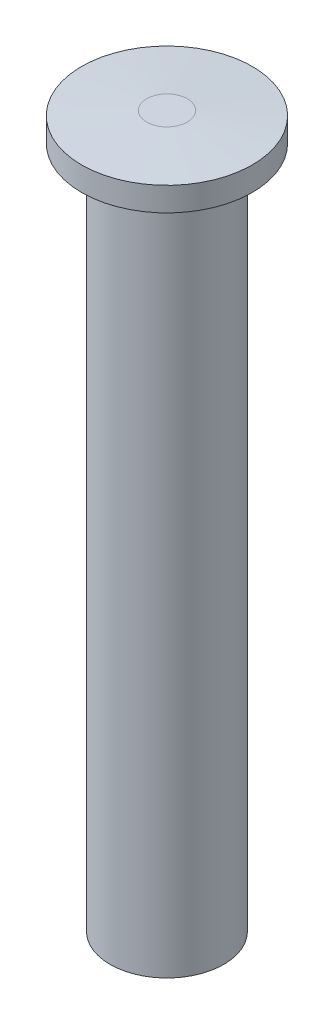
ISO-10303-21;
HEADER;
FILE_DESCRIPTION(('STEP AP214'),'2;1');
FILE_NAME('part.step','',(''),(''),'','','');
FILE_SCHEMA(('AUTOMOTIVE_DESIGN { 1 0 10303 214 1 1 1 1 }'));
ENDSEC;
DATA;
#1=APPLICATION_CONTEXT('core data for automotive mechanical design processes');
#2=APPLICATION_PROTOCOL_DEFINITION('international standard','automotive_design',2000,#1);
#3=PRODUCT_CONTEXT('',#1,'mechanical');
#4=PRODUCT('Part','Part','',(#3));
#5=PRODUCT_RELATED_PRODUCT_CATEGORY('part','',(#4));
#6=PRODUCT_DEFINITION_FORMATION('','',#4);
#7=PRODUCT_DEFINITION_CONTEXT('part definition',#1,'design');
#8=PRODUCT_DEFINITION('design','',#6,#7);
#9=PRODUCT_DEFINITION_SHAPE('','',#8);
#10=(LENGTH_UNIT() NAMED_UNIT(*) SI_UNIT(.MILLI.,.METRE.));
#11=(NAMED_UNIT(*) PLANE_ANGLE_UNIT() SI_UNIT($,.RADIAN.));
#12=(NAMED_UNIT(*) SI_UNIT($,.STERADIAN.) SOLID_ANGLE_UNIT());
#13=UNCERTAINTY_MEASURE_WITH_UNIT(LENGTH_MEASURE(1.E-05),#10,'distance_accuracy_value','');
#14=(GEOMETRIC_REPRESENTATION_CONTEXT(3) GLOBAL_UNCERTAINTY_ASSIGNED_CONTEXT((#13)) GLOBAL_UNIT_ASSIGNED_CONTEXT((#10,
#11,#12)) REPRESENTATION_CONTEXT('',''));
#15=CARTESIAN_POINT('',(0.,0.,0.));
#16=DIRECTION('',(0.,0.,1.));
#17=DIRECTION('',(1.,0.,0.));
#18=AXIS2_PLACEMENT_3D('',#15,#16,#17);
#19=CARTESIAN_POINT('',(0.,19.05,0.));
#20=DIRECTION('',(0.,-1.,0.));
#21=DIRECTION('',(0.,0.,-1.));
#22=AXIS2_PLACEMENT_3D('',#19,#20,#21);
#23=CYLINDRICAL_SURFACE('',#22,3.175);
#24=CARTESIAN_POINT('',(0.,19.05,0.));
#25=DIRECTION('',(0.,1.,0.));
#26=DIRECTION('',(0.,0.,1.));
#27=AXIS2_PLACEMENT_3D('',#24,#25,#26);
#28=CIRCLE('',#27,3.175);
#29=CARTESIAN_POINT('',(0.,19.05,3.175));
#30=VERTEX_POINT('',#29);
#31=EDGE_CURVE('E44',#30,#30,#28,.T.);
#32=ORIENTED_EDGE('',*,*,#31,.F.);
#33=EDGE_LOOP('',(#32));
#34=FACE_BOUND('',#33,.T.);
#35=CARTESIAN_POINT('',(0.,-19.05,0.));
#36=DIRECTION('',(0.,1.,0.));
#37=DIRECTION('',(0.,0.,1.));
#38=AXIS2_PLACEMENT_3D('',#35,#36,#37);
#39=CIRCLE('',#38,3.175);
#40=CARTESIAN_POINT('',(0.,-19.05,3.175));
#41=VERTEX_POINT('',#40);
#42=EDGE_CURVE('E48',#41,#41,#39,.T.);
#43=ORIENTED_EDGE('',*,*,#42,.T.);
#44=EDGE_LOOP('',(#43));
#45=FACE_BOUND('',#44,.T.);
#46=ADVANCED_FACE('F33',(#34,#45),#23,.T.);
#47=CARTESIAN_POINT('',(0.,-19.05,0.));
#48=DIRECTION('',(0.,1.,0.));
#49=DIRECTION('',(0.,0.,1.));
#50=AXIS2_PLACEMENT_3D('',#47,#48,#49);
#51=PLANE('',#50);
#52=ORIENTED_EDGE('',*,*,#42,.F.);
#53=EDGE_LOOP('',(#52));
#54=FACE_BOUND('',#53,.T.);
#55=ADVANCED_FACE('F72',(#54),#51,.F.);
#56=CARTESIAN_POINT('',(0.,20.6375,0.));
#57=DIRECTION('',(0.,-1.,0.));
#58=DIRECTION('',(0.,0.,-1.));
#59=AXIS2_PLACEMENT_3D('',#56,#57,#58);
#60=CYLINDRICAL_SURFACE('',#59,4.7625);
#61=CARTESIAN_POINT('',(0.,20.3835,0.));
#62=DIRECTION('',(0.,1.,0.));
#63=DIRECTION('',(0.,0.,1.));
#64=AXIS2_PLACEMENT_3D('',#61,#62,#63);
#65=CIRCLE('',#64,4.7625);
#66=CARTESIAN_POINT('',(0.,20.3835,4.7625));
#67=VERTEX_POINT('',#66);
#68=EDGE_CURVE('E10',#67,#67,#65,.F.);
#69=ORIENTED_EDGE('',*,*,#68,.T.);
#70=EDGE_LOOP('',(#69));
#71=FACE_BOUND('',#70,.T.);
#72=CARTESIAN_POINT('',(0.,19.05,0.));
#73=DIRECTION('',(0.,1.,0.));
#74=DIRECTION('',(0.,0.,1.));
#75=AXIS2_PLACEMENT_3D('',#72,#73,#74);
#76=CIRCLE('',#75,4.7625);
#77=CARTESIAN_POINT('',(0.,19.05,4.7625));
#78=VERTEX_POINT('',#77);
#79=EDGE_CURVE('E52',#78,#78,#76,.T.);
#80=ORIENTED_EDGE('',*,*,#79,.T.);
#81=EDGE_LOOP('',(#80));
#82=FACE_BOUND('',#81,.T.);
#83=ADVANCED_FACE('F57',(#71,#82),#60,.T.);
#84=CARTESIAN_POINT('',(0.,20.6375,0.));
#85=DIRECTION('',(0.,1.,0.));
#86=DIRECTION('',(0.,0.,1.));
#87=AXIS2_PLACEMENT_3D('',#84,#85,#86);
#88=PLANE('',#87);
#89=CARTESIAN_POINT('',(0.,20.6375,0.));
#90=DIRECTION('',(0.,1.,0.));
#91=DIRECTION('',(0.,0.,1.));
#92=AXIS2_PLACEMENT_3D('',#89,#90,#91);
#93=CIRCLE('',#92,1.13013077079516);
#94=CARTESIAN_POINT('',(0.,20.6375,1.13013077079516));
#95=VERTEX_POINT('',#94);
#96=EDGE_CURVE('E40',#95,#95,#93,.T.);
#97=ORIENTED_EDGE('',*,*,#96,.T.);
#98=EDGE_LOOP('',(#97));
#99=FACE_BOUND('',#98,.T.);
#100=ADVANCED_FACE('F61',(#99),#88,.T.);
#101=CARTESIAN_POINT('',(0.,19.05,0.));
#102=DIRECTION('',(0.,1.,0.));
#103=DIRECTION('',(0.,0.,1.));
#104=AXIS2_PLACEMENT_3D('',#101,#102,#103);
#105=PLANE('',#104);
#106=ORIENTED_EDGE('',*,*,#31,.T.);
#107=EDGE_LOOP('',(#106));
#108=FACE_BOUND('',#107,.T.);
#109=ORIENTED_EDGE('',*,*,#79,.F.);
#110=EDGE_LOOP('',(#109));
#111=FACE_BOUND('',#110,.T.);
#112=ADVANCED_FACE('F59',(#108,#111),#105,.F.);
#113=CARTESIAN_POINT('',(0.,20.6375,0.));
#114=DIRECTION('',(0.,-1.,0.));
#115=DIRECTION('',(0.,0.,-1.));
#116=AXIS2_PLACEMENT_3D('',#113,#114,#115);
#117=CONICAL_SURFACE('',#116,1.13013077079516,1.50098315671512);
#118=ORIENTED_EDGE('',*,*,#68,.F.);
#119=EDGE_LOOP('',(#118));
#120=FACE_BOUND('',#119,.T.);
#121=ORIENTED_EDGE('',*,*,#96,.F.);
#122=EDGE_LOOP('',(#121));
#123=FACE_BOUND('',#122,.T.);
#124=ADVANCED_FACE('F35',(#120,#123),#117,.T.);
#125=CLOSED_SHELL('',(#46,#55,#83,#100,#112,#124));
#126=MANIFOLD_SOLID_BREP('B2',#125);
#127=ADVANCED_BREP_SHAPE_REPRESENTATION('',(#18,#126),#14);
#128=SHAPE_DEFINITION_REPRESENTATION(#9,#127);
ENDSEC;
END-ISO-10303-21;
